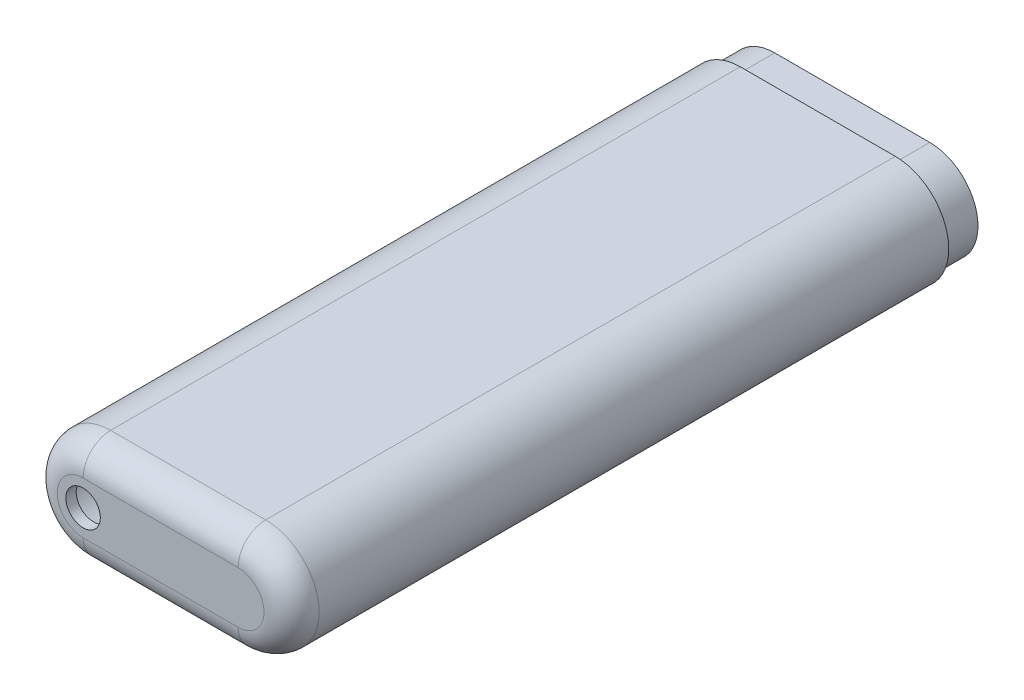
ISO-10303-21;
HEADER;
FILE_DESCRIPTION(('STEP AP214'),'2;1');
FILE_NAME('part.step','',(''),(''),'','','');
FILE_SCHEMA(('AUTOMOTIVE_DESIGN { 1 0 10303 214 1 1 1 1 }'));
ENDSEC;
DATA;
#1=APPLICATION_CONTEXT('core data for automotive mechanical design processes');
#2=APPLICATION_PROTOCOL_DEFINITION('international standard','automotive_design',2000,#1);
#3=PRODUCT_CONTEXT('',#1,'mechanical');
#4=PRODUCT('Part','Part','',(#3));
#5=PRODUCT_RELATED_PRODUCT_CATEGORY('part','',(#4));
#6=PRODUCT_DEFINITION_FORMATION('','',#4);
#7=PRODUCT_DEFINITION_CONTEXT('part definition',#1,'design');
#8=PRODUCT_DEFINITION('design','',#6,#7);
#9=PRODUCT_DEFINITION_SHAPE('','',#8);
#10=(LENGTH_UNIT() NAMED_UNIT(*) SI_UNIT(.MILLI.,.METRE.));
#11=(NAMED_UNIT(*) PLANE_ANGLE_UNIT() SI_UNIT($,.RADIAN.));
#12=(NAMED_UNIT(*) SI_UNIT($,.STERADIAN.) SOLID_ANGLE_UNIT());
#13=UNCERTAINTY_MEASURE_WITH_UNIT(LENGTH_MEASURE(1.E-05),#10,'distance_accuracy_value','');
#14=(GEOMETRIC_REPRESENTATION_CONTEXT(3) GLOBAL_UNCERTAINTY_ASSIGNED_CONTEXT((#13)) GLOBAL_UNIT_ASSIGNED_CONTEXT((#10,
#11,#12)) REPRESENTATION_CONTEXT('',''));
#15=CARTESIAN_POINT('',(0.,0.,0.));
#16=DIRECTION('',(0.,0.,1.));
#17=DIRECTION('',(1.,0.,0.));
#18=AXIS2_PLACEMENT_3D('',#15,#16,#17);
#19=CARTESIAN_POINT('',(105.,-9.86751496131017E-13,311.5));
#20=DIRECTION('',(0.,0.,1.));
#21=DIRECTION('',(1.,0.,0.));
#22=AXIS2_PLACEMENT_3D('',#19,#20,#21);
#23=CYLINDRICAL_SURFACE('',#22,5.);
#24=CARTESIAN_POINT('',(105.,-9.86751496131017E-13,333.5));
#25=DIRECTION('',(0.,0.,1.));
#26=DIRECTION('',(1.,0.,0.));
#27=AXIS2_PLACEMENT_3D('',#24,#25,#26);
#28=CIRCLE('',#27,5.);
#29=CARTESIAN_POINT('',(110.,-9.86751496131017E-13,333.5));
#30=VERTEX_POINT('',#29);
#31=EDGE_CURVE('E75',#30,#30,#28,.T.);
#32=ORIENTED_EDGE('',*,*,#31,.F.);
#33=EDGE_LOOP('',(#32));
#34=FACE_BOUND('',#33,.T.);
#35=CARTESIAN_POINT('',(105.,-9.86751496131017E-13,336.5));
#36=DIRECTION('',(0.,0.,1.));
#37=DIRECTION('',(1.,0.,0.));
#38=AXIS2_PLACEMENT_3D('',#35,#36,#37);
#39=CIRCLE('',#38,5.);
#40=CARTESIAN_POINT('',(110.,-9.86751496131017E-13,336.5));
#41=VERTEX_POINT('',#40);
#42=EDGE_CURVE('E318',#41,#41,#39,.T.);
#43=ORIENTED_EDGE('',*,*,#42,.T.);
#44=EDGE_LOOP('',(#43));
#45=FACE_BOUND('',#44,.T.);
#46=ADVANCED_FACE('F17',(#34,#45),#23,.F.);
#47=CARTESIAN_POINT('',(150.,-9.81853487402873E-13,109.498));
#48=DIRECTION('',(0.,0.,1.));
#49=DIRECTION('',(1.,0.,0.));
#50=AXIS2_PLACEMENT_3D('',#47,#48,#49);
#51=CYLINDRICAL_SURFACE('',#50,12.5);
#52=DIRECTION('',(0.,0.,1.));
#53=VECTOR('',#52,1.);
#54=CARTESIAN_POINT('',(150.,12.499999999999,109.498));
#55=LINE('',#54,#53);
#56=CARTESIAN_POINT('',(150.,12.499999999999,135.75));
#57=VERTEX_POINT('',#56);
#58=CARTESIAN_POINT('',(150.,12.499999999999,333.5));
#59=VERTEX_POINT('',#58);
#60=EDGE_CURVE('E11',#57,#59,#55,.T.);
#61=ORIENTED_EDGE('',*,*,#60,.F.);
#62=CARTESIAN_POINT('',(150.,-9.81853487402873E-13,135.75));
#63=DIRECTION('',(0.,0.,-1.));
#64=DIRECTION('',(1.,0.,0.));
#65=AXIS2_PLACEMENT_3D('',#62,#63,#64);
#66=CIRCLE('',#65,12.5);
#67=CARTESIAN_POINT('',(150.,-12.500000000001,135.75));
#68=VERTEX_POINT('',#67);
#69=EDGE_CURVE('E260',#57,#68,#66,.T.);
#70=ORIENTED_EDGE('',*,*,#69,.T.);
#71=DIRECTION('',(0.,0.,1.));
#72=VECTOR('',#71,1.);
#73=CARTESIAN_POINT('',(150.,-12.500000000001,109.498));
#74=LINE('',#73,#72);
#75=CARTESIAN_POINT('',(150.,-12.500000000001,333.5));
#76=VERTEX_POINT('',#75);
#77=EDGE_CURVE('E40',#68,#76,#74,.T.);
#78=ORIENTED_EDGE('',*,*,#77,.T.);
#79=CARTESIAN_POINT('',(150.,-9.81853487402873E-13,333.5));
#80=DIRECTION('',(0.,0.,1.));
#81=DIRECTION('',(1.,0.,0.));
#82=AXIS2_PLACEMENT_3D('',#79,#80,#81);
#83=CIRCLE('',#82,12.5);
#84=EDGE_CURVE('E222',#76,#59,#83,.T.);
#85=ORIENTED_EDGE('',*,*,#84,.T.);
#86=EDGE_LOOP('',(#61,#70,#78,#85));
#87=FACE_BOUND('',#86,.T.);
#88=ADVANCED_FACE('F368',(#87),#51,.F.);
#89=CARTESIAN_POINT('',(145.417424305044,12.499999999999,109.498));
#90=DIRECTION('',(0.,-1.,0.));
#91=DIRECTION('',(0.,0.,-1.));
#92=AXIS2_PLACEMENT_3D('',#89,#90,#91);
#93=PLANE('',#92);
#94=DIRECTION('',(0.,0.,1.));
#95=VECTOR('',#94,1.);
#96=CARTESIAN_POINT('',(105.,12.499999999999,109.498));
#97=LINE('',#96,#95);
#98=CARTESIAN_POINT('',(105.,12.499999999999,135.75));
#99=VERTEX_POINT('',#98);
#100=CARTESIAN_POINT('',(105.,12.499999999999,333.5));
#101=VERTEX_POINT('',#100);
#102=EDGE_CURVE('E27',#99,#101,#97,.T.);
#103=ORIENTED_EDGE('',*,*,#102,.F.);
#104=DIRECTION('',(-1.,0.,0.));
#105=VECTOR('',#104,1.);
#106=CARTESIAN_POINT('',(145.417424305044,12.499999999999,135.75));
#107=LINE('',#106,#105);
#108=EDGE_CURVE('E291',#57,#99,#107,.T.);
#109=ORIENTED_EDGE('',*,*,#108,.F.);
#110=ORIENTED_EDGE('',*,*,#60,.T.);
#111=DIRECTION('',(1.,0.,0.));
#112=VECTOR('',#111,1.);
#113=CARTESIAN_POINT('',(127.5,12.499999999999,333.5));
#114=LINE('',#113,#112);
#115=EDGE_CURVE('E218',#101,#59,#114,.T.);
#116=ORIENTED_EDGE('',*,*,#115,.F.);
#117=EDGE_LOOP('',(#103,#109,#110,#116));
#118=FACE_BOUND('',#117,.T.);
#119=ADVANCED_FACE('F374',(#118),#93,.T.);
#120=CARTESIAN_POINT('',(105.,-9.87057657830803E-13,109.498));
#121=DIRECTION('',(0.,0.,1.));
#122=DIRECTION('',(1.,0.,0.));
#123=AXIS2_PLACEMENT_3D('',#120,#121,#122);
#124=CYLINDRICAL_SURFACE('',#123,12.5);
#125=DIRECTION('',(0.,0.,1.));
#126=VECTOR('',#125,1.);
#127=CARTESIAN_POINT('',(105.,-12.500000000001,109.498));
#128=LINE('',#127,#126);
#129=CARTESIAN_POINT('',(105.,-12.500000000001,135.75));
#130=VERTEX_POINT('',#129);
#131=CARTESIAN_POINT('',(105.,-12.500000000001,333.5));
#132=VERTEX_POINT('',#131);
#133=EDGE_CURVE('E249',#130,#132,#128,.T.);
#134=ORIENTED_EDGE('',*,*,#133,.F.);
#135=CARTESIAN_POINT('',(105.,-9.87057657830803E-13,135.75));
#136=DIRECTION('',(0.,0.,-1.));
#137=DIRECTION('',(1.,0.,0.));
#138=AXIS2_PLACEMENT_3D('',#135,#136,#137);
#139=CIRCLE('',#138,12.5);
#140=EDGE_CURVE('E287',#130,#99,#139,.T.);
#141=ORIENTED_EDGE('',*,*,#140,.T.);
#142=ORIENTED_EDGE('',*,*,#102,.T.);
#143=CARTESIAN_POINT('',(105.,-9.87057657830803E-13,333.5));
#144=DIRECTION('',(0.,0.,1.));
#145=DIRECTION('',(1.,0.,0.));
#146=AXIS2_PLACEMENT_3D('',#143,#144,#145);
#147=CIRCLE('',#146,12.5);
#148=EDGE_CURVE('E215',#101,#132,#147,.T.);
#149=ORIENTED_EDGE('',*,*,#148,.T.);
#150=EDGE_LOOP('',(#134,#141,#142,#149));
#151=FACE_BOUND('',#150,.T.);
#152=ADVANCED_FACE('F418',(#151),#124,.F.);
#153=CARTESIAN_POINT('',(145.417424305044,-12.500000000001,109.498));
#154=DIRECTION('',(0.,-1.,0.));
#155=DIRECTION('',(0.,0.,-1.));
#156=AXIS2_PLACEMENT_3D('',#153,#154,#155);
#157=PLANE('',#156);
#158=ORIENTED_EDGE('',*,*,#77,.F.);
#159=DIRECTION('',(-1.,0.,0.));
#160=VECTOR('',#159,1.);
#161=CARTESIAN_POINT('',(145.417424305044,-12.500000000001,135.75));
#162=LINE('',#161,#160);
#163=EDGE_CURVE('E290',#68,#130,#162,.T.);
#164=ORIENTED_EDGE('',*,*,#163,.T.);
#165=ORIENTED_EDGE('',*,*,#133,.T.);
#166=DIRECTION('',(1.,0.,0.));
#167=VECTOR('',#166,1.);
#168=CARTESIAN_POINT('',(109.582575694956,-12.500000000001,333.5));
#169=LINE('',#168,#167);
#170=EDGE_CURVE('E219',#132,#76,#169,.T.);
#171=ORIENTED_EDGE('',*,*,#170,.T.);
#172=EDGE_LOOP('',(#158,#164,#165,#171));
#173=FACE_BOUND('',#172,.T.);
#174=ADVANCED_FACE('F414',(#173),#157,.F.);
#175=CARTESIAN_POINT('',(127.5,-9.85322934354826E-13,333.5));
#176=DIRECTION('',(0.,0.,1.));
#177=DIRECTION('',(1.,0.,0.));
#178=AXIS2_PLACEMENT_3D('',#175,#176,#177);
#179=PLANE('',#178);
#180=ORIENTED_EDGE('',*,*,#148,.F.);
#181=ORIENTED_EDGE('',*,*,#115,.T.);
#182=ORIENTED_EDGE('',*,*,#84,.F.);
#183=ORIENTED_EDGE('',*,*,#170,.F.);
#184=EDGE_LOOP('',(#180,#181,#182,#183));
#185=FACE_BOUND('',#184,.T.);
#186=ORIENTED_EDGE('',*,*,#31,.T.);
#187=EDGE_LOOP('',(#186));
#188=FACE_BOUND('',#187,.T.);
#189=ADVANCED_FACE('F417',(#185,#188),#179,.F.);
#190=CARTESIAN_POINT('',(127.5,-9.85322934354826E-13,135.75));
#191=DIRECTION('',(0.,0.,-1.));
#192=DIRECTION('',(0.,-1.,0.));
#193=AXIS2_PLACEMENT_3D('',#190,#191,#192);
#194=PLANE('',#193);
#195=ORIENTED_EDGE('',*,*,#108,.T.);
#196=ORIENTED_EDGE('',*,*,#140,.F.);
#197=ORIENTED_EDGE('',*,*,#163,.F.);
#198=ORIENTED_EDGE('',*,*,#69,.F.);
#199=EDGE_LOOP('',(#195,#196,#197,#198));
#200=FACE_BOUND('',#199,.T.);
#201=DIRECTION('',(1.,0.,0.));
#202=VECTOR('',#201,1.);
#203=CARTESIAN_POINT('',(127.5,13.999999999999,135.75));
#204=LINE('',#203,#202);
#205=CARTESIAN_POINT('',(105.,13.999999999999,135.75));
#206=VERTEX_POINT('',#205);
#207=CARTESIAN_POINT('',(150.,13.999999999999,135.75));
#208=VERTEX_POINT('',#207);
#209=EDGE_CURVE('E274',#206,#208,#204,.T.);
#210=ORIENTED_EDGE('',*,*,#209,.T.);
#211=CARTESIAN_POINT('',(150.,-9.81853487402873E-13,135.75));
#212=DIRECTION('',(0.,0.,-1.));
#213=DIRECTION('',(-1.,0.,0.));
#214=AXIS2_PLACEMENT_3D('',#211,#212,#213);
#215=CIRCLE('',#214,14.);
#216=CARTESIAN_POINT('',(150.,-14.000000000001,135.75));
#217=VERTEX_POINT('',#216);
#218=EDGE_CURVE('E232',#208,#217,#215,.T.);
#219=ORIENTED_EDGE('',*,*,#218,.T.);
#220=DIRECTION('',(1.,0.,0.));
#221=VECTOR('',#220,1.);
#222=CARTESIAN_POINT('',(127.5,-14.000000000001,135.75));
#223=LINE('',#222,#221);
#224=CARTESIAN_POINT('',(105.,-14.000000000001,135.75));
#225=VERTEX_POINT('',#224);
#226=EDGE_CURVE('E253',#225,#217,#223,.T.);
#227=ORIENTED_EDGE('',*,*,#226,.F.);
#228=CARTESIAN_POINT('',(105.,-9.87057657830803E-13,135.75));
#229=DIRECTION('',(0.,0.,-1.));
#230=DIRECTION('',(-1.,0.,0.));
#231=AXIS2_PLACEMENT_3D('',#228,#229,#230);
#232=CIRCLE('',#231,14.);
#233=EDGE_CURVE('E255',#225,#206,#232,.T.);
#234=ORIENTED_EDGE('',*,*,#233,.T.);
#235=EDGE_LOOP('',(#210,#219,#227,#234));
#236=FACE_BOUND('',#235,.T.);
#237=ADVANCED_FACE('F391',(#200,#236),#194,.T.);
#238=CARTESIAN_POINT('',(105.,-9.87057657830803E-13,135.75));
#239=DIRECTION('',(0.,0.,1.));
#240=DIRECTION('',(1.,0.,0.));
#241=AXIS2_PLACEMENT_3D('',#238,#239,#240);
#242=CYLINDRICAL_SURFACE('',#241,14.);
#243=CARTESIAN_POINT('',(105.,-9.87057657830803E-13,145.75));
#244=DIRECTION('',(0.,0.,-1.));
#245=DIRECTION('',(-1.,0.,0.));
#246=AXIS2_PLACEMENT_3D('',#243,#244,#245);
#247=CIRCLE('',#246,14.);
#248=CARTESIAN_POINT('',(105.,-14.000000000001,145.75));
#249=VERTEX_POINT('',#248);
#250=CARTESIAN_POINT('',(105.,13.999999999999,145.75));
#251=VERTEX_POINT('',#250);
#252=EDGE_CURVE('E210',#249,#251,#247,.T.);
#253=ORIENTED_EDGE('',*,*,#252,.T.);
#254=DIRECTION('',(0.,0.,1.));
#255=VECTOR('',#254,1.);
#256=CARTESIAN_POINT('',(105.,13.999999999999,135.75));
#257=LINE('',#256,#255);
#258=EDGE_CURVE('E233',#206,#251,#257,.T.);
#259=ORIENTED_EDGE('',*,*,#258,.F.);
#260=ORIENTED_EDGE('',*,*,#233,.F.);
#261=DIRECTION('',(0.,0.,1.));
#262=VECTOR('',#261,1.);
#263=CARTESIAN_POINT('',(105.,-14.000000000001,135.75));
#264=LINE('',#263,#262);
#265=EDGE_CURVE('E256',#225,#249,#264,.T.);
#266=ORIENTED_EDGE('',*,*,#265,.T.);
#267=EDGE_LOOP('',(#253,#259,#260,#266));
#268=FACE_BOUND('',#267,.T.);
#269=ADVANCED_FACE('F386',(#268),#242,.T.);
#270=CARTESIAN_POINT('',(127.5,-14.000000000001,135.75));
#271=DIRECTION('',(0.,-1.,0.));
#272=DIRECTION('',(0.,0.,-1.));
#273=AXIS2_PLACEMENT_3D('',#270,#271,#272);
#274=PLANE('',#273);
#275=DIRECTION('',(1.,0.,0.));
#276=VECTOR('',#275,1.);
#277=CARTESIAN_POINT('',(127.5,-14.000000000001,145.75));
#278=LINE('',#277,#276);
#279=CARTESIAN_POINT('',(150.,-14.000000000001,145.75));
#280=VERTEX_POINT('',#279);
#281=EDGE_CURVE('E213',#249,#280,#278,.T.);
#282=ORIENTED_EDGE('',*,*,#281,.F.);
#283=ORIENTED_EDGE('',*,*,#265,.F.);
#284=ORIENTED_EDGE('',*,*,#226,.T.);
#285=DIRECTION('',(0.,0.,1.));
#286=VECTOR('',#285,1.);
#287=CARTESIAN_POINT('',(150.,-14.000000000001,135.75));
#288=LINE('',#287,#286);
#289=EDGE_CURVE('E230',#217,#280,#288,.T.);
#290=ORIENTED_EDGE('',*,*,#289,.T.);
#291=EDGE_LOOP('',(#282,#283,#284,#290));
#292=FACE_BOUND('',#291,.T.);
#293=ADVANCED_FACE('F383',(#292),#274,.T.);
#294=CARTESIAN_POINT('',(150.,-9.81853487402873E-13,135.75));
#295=DIRECTION('',(0.,0.,1.));
#296=DIRECTION('',(1.,0.,0.));
#297=AXIS2_PLACEMENT_3D('',#294,#295,#296);
#298=CYLINDRICAL_SURFACE('',#297,14.);
#299=CARTESIAN_POINT('',(150.,-9.81853487402873E-13,145.75));
#300=DIRECTION('',(0.,0.,-1.));
#301=DIRECTION('',(-1.,0.,0.));
#302=AXIS2_PLACEMENT_3D('',#299,#300,#301);
#303=CIRCLE('',#302,14.);
#304=CARTESIAN_POINT('',(150.,13.999999999999,145.75));
#305=VERTEX_POINT('',#304);
#306=EDGE_CURVE('E245',#305,#280,#303,.T.);
#307=ORIENTED_EDGE('',*,*,#306,.T.);
#308=ORIENTED_EDGE('',*,*,#289,.F.);
#309=ORIENTED_EDGE('',*,*,#218,.F.);
#310=DIRECTION('',(0.,0.,1.));
#311=VECTOR('',#310,1.);
#312=CARTESIAN_POINT('',(150.,13.999999999999,135.75));
#313=LINE('',#312,#311);
#314=EDGE_CURVE('E278',#208,#305,#313,.T.);
#315=ORIENTED_EDGE('',*,*,#314,.T.);
#316=EDGE_LOOP('',(#307,#308,#309,#315));
#317=FACE_BOUND('',#316,.T.);
#318=ADVANCED_FACE('F380',(#317),#298,.T.);
#319=CARTESIAN_POINT('',(127.5,13.999999999999,135.75));
#320=DIRECTION('',(0.,-1.,0.));
#321=DIRECTION('',(0.,0.,-1.));
#322=AXIS2_PLACEMENT_3D('',#319,#320,#321);
#323=PLANE('',#322);
#324=DIRECTION('',(1.,0.,0.));
#325=VECTOR('',#324,1.);
#326=CARTESIAN_POINT('',(127.5,13.999999999999,145.75));
#327=LINE('',#326,#325);
#328=EDGE_CURVE('E214',#251,#305,#327,.T.);
#329=ORIENTED_EDGE('',*,*,#328,.T.);
#330=ORIENTED_EDGE('',*,*,#314,.F.);
#331=ORIENTED_EDGE('',*,*,#209,.F.);
#332=ORIENTED_EDGE('',*,*,#258,.T.);
#333=EDGE_LOOP('',(#329,#330,#331,#332));
#334=FACE_BOUND('',#333,.T.);
#335=ADVANCED_FACE('F382',(#334),#323,.F.);
#336=CARTESIAN_POINT('',(123.628328608915,-1.61755140785342,145.75));
#337=DIRECTION('',(0.,0.,1.));
#338=DIRECTION('',(1.,0.,0.));
#339=AXIS2_PLACEMENT_3D('',#336,#337,#338);
#340=PLANE('',#339);
#341=DIRECTION('',(1.,0.,0.));
#342=VECTOR('',#341,1.);
#343=CARTESIAN_POINT('',(127.5,15.499999999999,145.75));
#344=LINE('',#343,#342);
#345=CARTESIAN_POINT('',(105.,15.499999999999,145.75));
#346=VERTEX_POINT('',#345);
#347=CARTESIAN_POINT('',(150.,15.499999999999,145.75));
#348=VERTEX_POINT('',#347);
#349=EDGE_CURVE('E170',#346,#348,#344,.T.);
#350=ORIENTED_EDGE('',*,*,#349,.T.);
#351=CARTESIAN_POINT('',(150.,-9.81853487402873E-13,145.75));
#352=DIRECTION('',(0.,0.,1.));
#353=DIRECTION('',(1.,0.,0.));
#354=AXIS2_PLACEMENT_3D('',#351,#352,#353);
#355=CIRCLE('',#354,15.5);
#356=CARTESIAN_POINT('',(150.,-15.500000000001,145.75));
#357=VERTEX_POINT('',#356);
#358=EDGE_CURVE('E176',#357,#348,#355,.T.);
#359=ORIENTED_EDGE('',*,*,#358,.F.);
#360=DIRECTION('',(1.,0.,0.));
#361=VECTOR('',#360,1.);
#362=CARTESIAN_POINT('',(127.5,-15.500000000001,145.75));
#363=LINE('',#362,#361);
#364=CARTESIAN_POINT('',(105.,-15.500000000001,145.75));
#365=VERTEX_POINT('',#364);
#366=EDGE_CURVE('E183',#365,#357,#363,.T.);
#367=ORIENTED_EDGE('',*,*,#366,.F.);
#368=CARTESIAN_POINT('',(105.,-9.87057657830803E-13,145.75));
#369=DIRECTION('',(0.,0.,1.));
#370=DIRECTION('',(1.,0.,0.));
#371=AXIS2_PLACEMENT_3D('',#368,#369,#370);
#372=CIRCLE('',#371,15.5);
#373=EDGE_CURVE('E178',#346,#365,#372,.T.);
#374=ORIENTED_EDGE('',*,*,#373,.F.);
#375=EDGE_LOOP('',(#350,#359,#367,#374));
#376=FACE_BOUND('',#375,.T.);
#377=ORIENTED_EDGE('',*,*,#328,.F.);
#378=ORIENTED_EDGE('',*,*,#252,.F.);
#379=ORIENTED_EDGE('',*,*,#281,.T.);
#380=ORIENTED_EDGE('',*,*,#306,.F.);
#381=EDGE_LOOP('',(#377,#378,#379,#380));
#382=FACE_BOUND('',#381,.T.);
#383=ADVANCED_FACE('F172',(#376,#382),#340,.F.);
#384=CARTESIAN_POINT('',(105.,-9.87057657830803E-13,333.502));
#385=DIRECTION('',(0.,0.,-1.));
#386=DIRECTION('',(-1.,0.,0.));
#387=AXIS2_PLACEMENT_3D('',#384,#385,#386);
#388=CYLINDRICAL_SURFACE('',#387,15.5);
#389=DIRECTION('',(0.,0.,-1.));
#390=VECTOR('',#389,1.);
#391=CARTESIAN_POINT('',(105.,15.499999999999,333.502));
#392=LINE('',#391,#390);
#393=CARTESIAN_POINT('',(105.,15.499999999999,328.5));
#394=VERTEX_POINT('',#393);
#395=EDGE_CURVE('E182',#394,#346,#392,.T.);
#396=ORIENTED_EDGE('',*,*,#395,.T.);
#397=ORIENTED_EDGE('',*,*,#373,.T.);
#398=DIRECTION('',(0.,0.,-1.));
#399=VECTOR('',#398,1.);
#400=CARTESIAN_POINT('',(105.,-15.500000000001,333.502));
#401=LINE('',#400,#399);
#402=CARTESIAN_POINT('',(105.,-15.500000000001,328.5));
#403=VERTEX_POINT('',#402);
#404=EDGE_CURVE('E195',#403,#365,#401,.T.);
#405=ORIENTED_EDGE('',*,*,#404,.F.);
#406=CARTESIAN_POINT('',(105.,-9.87057657830803E-13,328.5));
#407=DIRECTION('',(0.,0.,-1.));
#408=DIRECTION('',(1.,0.,0.));
#409=AXIS2_PLACEMENT_3D('',#406,#407,#408);
#410=CIRCLE('',#409,15.5);
#411=EDGE_CURVE('E273',#403,#394,#410,.T.);
#412=ORIENTED_EDGE('',*,*,#411,.T.);
#413=EDGE_LOOP('',(#396,#397,#405,#412));
#414=FACE_BOUND('',#413,.T.);
#415=ADVANCED_FACE('F411',(#414),#388,.T.);
#416=CARTESIAN_POINT('',(127.5,15.499999999999,333.502));
#417=DIRECTION('',(0.,1.,0.));
#418=DIRECTION('',(1.,0.,0.));
#419=AXIS2_PLACEMENT_3D('',#416,#417,#418);
#420=PLANE('',#419);
#421=DIRECTION('',(0.,0.,-1.));
#422=VECTOR('',#421,1.);
#423=CARTESIAN_POINT('',(150.,15.499999999999,333.502));
#424=LINE('',#423,#422);
#425=CARTESIAN_POINT('',(150.,15.499999999999,328.5));
#426=VERTEX_POINT('',#425);
#427=EDGE_CURVE('E186',#426,#348,#424,.T.);
#428=ORIENTED_EDGE('',*,*,#427,.T.);
#429=ORIENTED_EDGE('',*,*,#349,.F.);
#430=ORIENTED_EDGE('',*,*,#395,.F.);
#431=DIRECTION('',(1.,0.,0.));
#432=VECTOR('',#431,1.);
#433=CARTESIAN_POINT('',(127.5,15.499999999999,328.5));
#434=LINE('',#433,#432);
#435=EDGE_CURVE('E189',#394,#426,#434,.T.);
#436=ORIENTED_EDGE('',*,*,#435,.T.);
#437=EDGE_LOOP('',(#428,#429,#430,#436));
#438=FACE_BOUND('',#437,.T.);
#439=ADVANCED_FACE('F187',(#438),#420,.T.);
#440=CARTESIAN_POINT('',(127.5,-15.500000000001,333.502));
#441=DIRECTION('',(0.,1.,0.));
#442=DIRECTION('',(1.,0.,0.));
#443=AXIS2_PLACEMENT_3D('',#440,#441,#442);
#444=PLANE('',#443);
#445=ORIENTED_EDGE('',*,*,#404,.T.);
#446=ORIENTED_EDGE('',*,*,#366,.T.);
#447=DIRECTION('',(0.,0.,-1.));
#448=VECTOR('',#447,1.);
#449=CARTESIAN_POINT('',(150.,-15.500000000001,333.502));
#450=LINE('',#449,#448);
#451=CARTESIAN_POINT('',(150.,-15.500000000001,328.5));
#452=VERTEX_POINT('',#451);
#453=EDGE_CURVE('E198',#452,#357,#450,.T.);
#454=ORIENTED_EDGE('',*,*,#453,.F.);
#455=DIRECTION('',(-1.,0.,0.));
#456=VECTOR('',#455,1.);
#457=CARTESIAN_POINT('',(105.,-15.500000000001,328.5));
#458=LINE('',#457,#456);
#459=EDGE_CURVE('E21',#452,#403,#458,.T.);
#460=ORIENTED_EDGE('',*,*,#459,.T.);
#461=EDGE_LOOP('',(#445,#446,#454,#460));
#462=FACE_BOUND('',#461,.T.);
#463=ADVANCED_FACE('F19',(#462),#444,.F.);
#464=CARTESIAN_POINT('',(150.,-9.81853487402873E-13,333.502));
#465=DIRECTION('',(0.,0.,-1.));
#466=DIRECTION('',(-1.,0.,0.));
#467=AXIS2_PLACEMENT_3D('',#464,#465,#466);
#468=CYLINDRICAL_SURFACE('',#467,15.5);
#469=ORIENTED_EDGE('',*,*,#453,.T.);
#470=ORIENTED_EDGE('',*,*,#358,.T.);
#471=ORIENTED_EDGE('',*,*,#427,.F.);
#472=CARTESIAN_POINT('',(150.,-9.81853487402873E-13,328.5));
#473=DIRECTION('',(0.,0.,-1.));
#474=DIRECTION('',(1.,0.,0.));
#475=AXIS2_PLACEMENT_3D('',#472,#473,#474);
#476=CIRCLE('',#475,15.5);
#477=EDGE_CURVE('E205',#426,#452,#476,.T.);
#478=ORIENTED_EDGE('',*,*,#477,.T.);
#479=EDGE_LOOP('',(#469,#470,#471,#478));
#480=FACE_BOUND('',#479,.T.);
#481=ADVANCED_FACE('F197',(#480),#468,.T.);
#482=CARTESIAN_POINT('',(150.,-9.81853487402873E-13,328.5));
#483=DIRECTION('',(0.,0.,1.));
#484=DIRECTION('',(1.,0.,0.));
#485=AXIS2_PLACEMENT_3D('',#482,#483,#484);
#486=DEGENERATE_TOROIDAL_SURFACE('',#485,7.5,8.,.T.);
#487=CARTESIAN_POINT('',(150.,-7.50000000000098,328.5));
#488=DIRECTION('',(-1.,0.,0.));
#489=DIRECTION('',(0.,0.,1.));
#490=AXIS2_PLACEMENT_3D('',#487,#488,#489);
#491=CIRCLE('',#490,8.);
#492=CARTESIAN_POINT('',(150.,-7.50000000000098,336.5));
#493=VERTEX_POINT('',#492);
#494=EDGE_CURVE('E225',#452,#493,#491,.T.);
#495=ORIENTED_EDGE('',*,*,#494,.F.);
#496=ORIENTED_EDGE('',*,*,#477,.F.);
#497=CARTESIAN_POINT('',(150.,7.49999999999902,328.5));
#498=DIRECTION('',(-1.,0.,0.));
#499=DIRECTION('',(0.,0.,1.));
#500=AXIS2_PLACEMENT_3D('',#497,#498,#499);
#501=CIRCLE('',#500,8.);
#502=CARTESIAN_POINT('',(150.,7.49999999999902,336.5));
#503=VERTEX_POINT('',#502);
#504=EDGE_CURVE('E226',#503,#426,#501,.T.);
#505=ORIENTED_EDGE('',*,*,#504,.F.);
#506=CARTESIAN_POINT('',(150.,-9.81853487402873E-13,336.5));
#507=DIRECTION('',(0.,0.,1.));
#508=DIRECTION('',(1.,0.,0.));
#509=AXIS2_PLACEMENT_3D('',#506,#507,#508);
#510=CIRCLE('',#509,7.5);
#511=EDGE_CURVE('E239',#493,#503,#510,.T.);
#512=ORIENTED_EDGE('',*,*,#511,.F.);
#513=EDGE_LOOP('',(#495,#496,#505,#512));
#514=FACE_BOUND('',#513,.T.);
#515=ADVANCED_FACE('F355',(#514),#486,.T.);
#516=CARTESIAN_POINT('',(127.5,-7.50000000000099,328.5));
#517=DIRECTION('',(-1.,0.,0.));
#518=DIRECTION('',(0.,-1.,0.));
#519=AXIS2_PLACEMENT_3D('',#516,#517,#518);
#520=CYLINDRICAL_SURFACE('',#519,8.);
#521=ORIENTED_EDGE('',*,*,#494,.T.);
#522=DIRECTION('',(1.,0.,0.));
#523=VECTOR('',#522,1.);
#524=CARTESIAN_POINT('',(150.,-7.50000000000098,336.5));
#525=LINE('',#524,#523);
#526=CARTESIAN_POINT('',(105.,-7.50000000000099,336.5));
#527=VERTEX_POINT('',#526);
#528=EDGE_CURVE('E235',#527,#493,#525,.T.);
#529=ORIENTED_EDGE('',*,*,#528,.F.);
#530=CARTESIAN_POINT('',(105.,-7.50000000000099,328.5));
#531=DIRECTION('',(-1.,0.,0.));
#532=DIRECTION('',(0.,0.,1.));
#533=AXIS2_PLACEMENT_3D('',#530,#531,#532);
#534=CIRCLE('',#533,8.);
#535=EDGE_CURVE('E270',#403,#527,#534,.T.);
#536=ORIENTED_EDGE('',*,*,#535,.F.);
#537=ORIENTED_EDGE('',*,*,#459,.F.);
#538=EDGE_LOOP('',(#521,#529,#536,#537));
#539=FACE_BOUND('',#538,.T.);
#540=ADVANCED_FACE('F353',(#539),#520,.T.);
#541=CARTESIAN_POINT('',(127.5,7.49999999999902,328.5));
#542=DIRECTION('',(1.,0.,0.));
#543=DIRECTION('',(0.,1.,0.));
#544=AXIS2_PLACEMENT_3D('',#541,#542,#543);
#545=CYLINDRICAL_SURFACE('',#544,8.);
#546=ORIENTED_EDGE('',*,*,#504,.T.);
#547=ORIENTED_EDGE('',*,*,#435,.F.);
#548=CARTESIAN_POINT('',(105.,7.49999999999902,328.5));
#549=DIRECTION('',(-1.,0.,0.));
#550=DIRECTION('',(0.,0.,1.));
#551=AXIS2_PLACEMENT_3D('',#548,#549,#550);
#552=CIRCLE('',#551,8.);
#553=CARTESIAN_POINT('',(105.,7.49999999999902,336.5));
#554=VERTEX_POINT('',#553);
#555=EDGE_CURVE('E303',#554,#394,#552,.T.);
#556=ORIENTED_EDGE('',*,*,#555,.F.);
#557=DIRECTION('',(-1.,0.,0.));
#558=VECTOR('',#557,1.);
#559=CARTESIAN_POINT('',(127.5,7.49999999999902,336.5));
#560=LINE('',#559,#558);
#561=EDGE_CURVE('E209',#503,#554,#560,.T.);
#562=ORIENTED_EDGE('',*,*,#561,.F.);
#563=EDGE_LOOP('',(#546,#547,#556,#562));
#564=FACE_BOUND('',#563,.T.);
#565=ADVANCED_FACE('F342',(#564),#545,.T.);
#566=CARTESIAN_POINT('',(105.,-9.87057657830803E-13,328.5));
#567=DIRECTION('',(0.,0.,1.));
#568=DIRECTION('',(1.,0.,0.));
#569=AXIS2_PLACEMENT_3D('',#566,#567,#568);
#570=DEGENERATE_TOROIDAL_SURFACE('',#569,7.5,8.,.T.);
#571=ORIENTED_EDGE('',*,*,#555,.T.);
#572=ORIENTED_EDGE('',*,*,#411,.F.);
#573=ORIENTED_EDGE('',*,*,#535,.T.);
#574=CARTESIAN_POINT('',(105.,-9.87057657830803E-13,336.5));
#575=DIRECTION('',(0.,0.,1.));
#576=DIRECTION('',(1.,0.,0.));
#577=AXIS2_PLACEMENT_3D('',#574,#575,#576);
#578=CIRCLE('',#577,7.5);
#579=EDGE_CURVE('E240',#554,#527,#578,.T.);
#580=ORIENTED_EDGE('',*,*,#579,.F.);
#581=EDGE_LOOP('',(#571,#572,#573,#580));
#582=FACE_BOUND('',#581,.T.);
#583=ADVANCED_FACE('F349',(#582),#570,.T.);
#584=CARTESIAN_POINT('',(127.5,-9.85322934354826E-13,336.5));
#585=DIRECTION('',(0.,0.,1.));
#586=DIRECTION('',(1.,0.,0.));
#587=AXIS2_PLACEMENT_3D('',#584,#585,#586);
#588=PLANE('',#587);
#589=ORIENTED_EDGE('',*,*,#561,.T.);
#590=ORIENTED_EDGE('',*,*,#579,.T.);
#591=ORIENTED_EDGE('',*,*,#528,.T.);
#592=ORIENTED_EDGE('',*,*,#511,.T.);
#593=EDGE_LOOP('',(#589,#590,#591,#592));
#594=FACE_BOUND('',#593,.T.);
#595=ORIENTED_EDGE('',*,*,#42,.F.);
#596=EDGE_LOOP('',(#595));
#597=FACE_BOUND('',#596,.T.);
#598=ADVANCED_FACE('F336',(#594,#597),#588,.T.);
#599=CLOSED_SHELL('',(#46,#88,#119,#152,#174,#189,#237,#269,#293,#318,#335,#383,#415,#439,#463,
#481,#515,#540,#565,#583,#598));
#600=MANIFOLD_SOLID_BREP('B1',#599);
#601=ADVANCED_BREP_SHAPE_REPRESENTATION('',(#18,#600),#14);
#602=SHAPE_DEFINITION_REPRESENTATION(#9,#601);
ENDSEC;
END-ISO-10303-21;
